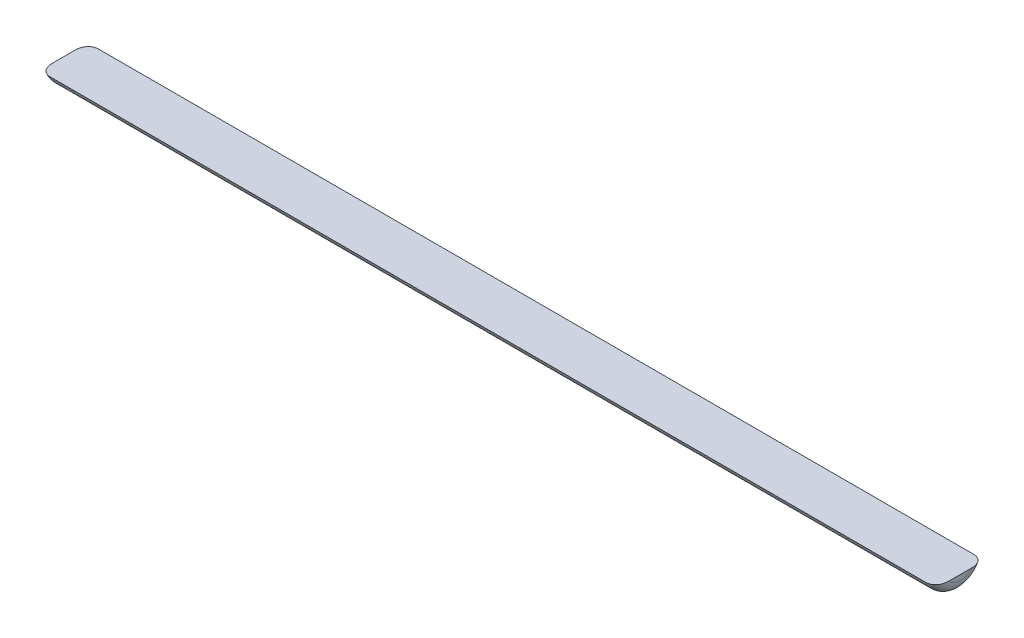
ISO-10303-21;
HEADER;
FILE_DESCRIPTION(('STEP AP214'),'2;1');
FILE_NAME('part.step','',(''),(''),'','','');
FILE_SCHEMA(('AUTOMOTIVE_DESIGN { 1 0 10303 214 1 1 1 1 }'));
ENDSEC;
DATA;
#1=APPLICATION_CONTEXT('core data for automotive mechanical design processes');
#2=APPLICATION_PROTOCOL_DEFINITION('international standard','automotive_design',2000,#1);
#3=PRODUCT_CONTEXT('',#1,'mechanical');
#4=PRODUCT('Part','Part','',(#3));
#5=PRODUCT_RELATED_PRODUCT_CATEGORY('part','',(#4));
#6=PRODUCT_DEFINITION_FORMATION('','',#4);
#7=PRODUCT_DEFINITION_CONTEXT('part definition',#1,'design');
#8=PRODUCT_DEFINITION('design','',#6,#7);
#9=PRODUCT_DEFINITION_SHAPE('','',#8);
#10=(LENGTH_UNIT() NAMED_UNIT(*) SI_UNIT(.MILLI.,.METRE.));
#11=(NAMED_UNIT(*) PLANE_ANGLE_UNIT() SI_UNIT($,.RADIAN.));
#12=(NAMED_UNIT(*) SI_UNIT($,.STERADIAN.) SOLID_ANGLE_UNIT());
#13=UNCERTAINTY_MEASURE_WITH_UNIT(LENGTH_MEASURE(1.E-05),#10,'distance_accuracy_value','');
#14=(GEOMETRIC_REPRESENTATION_CONTEXT(3) GLOBAL_UNCERTAINTY_ASSIGNED_CONTEXT((#13)) GLOBAL_UNIT_ASSIGNED_CONTEXT((#10,
#11,#12)) REPRESENTATION_CONTEXT('',''));
#15=CARTESIAN_POINT('',(0.,0.,0.));
#16=DIRECTION('',(0.,0.,1.));
#17=DIRECTION('',(1.,0.,0.));
#18=AXIS2_PLACEMENT_3D('',#15,#16,#17);
#19=CARTESIAN_POINT('',(170.,0.,0.));
#20=DIRECTION('',(-1.,0.,0.));
#21=DIRECTION('',(0.,0.,1.));
#22=AXIS2_PLACEMENT_3D('',#19,#20,#21);
#23=CYLINDRICAL_SURFACE('',#22,5.);
#24=DIRECTION('',(-1.,0.,0.));
#25=VECTOR('',#24,1.);
#26=CARTESIAN_POINT('',(170.,-2.01726919373693,4.575));
#27=LINE('',#26,#25);
#28=CARTESIAN_POINT('',(168.,-2.01726919373693,4.575));
#29=VERTEX_POINT('',#28);
#30=CARTESIAN_POINT('',(2.,-2.01726919373693,4.575));
#31=VERTEX_POINT('',#30);
#32=EDGE_CURVE('E96',#29,#31,#27,.T.);
#33=ORIENTED_EDGE('',*,*,#32,.T.);
#34=CARTESIAN_POINT('',(2.,0.,0.));
#35=DIRECTION('',(1.,0.,0.));
#36=DIRECTION('',(0.,0.,-1.));
#37=AXIS2_PLACEMENT_3D('',#34,#35,#36);
#38=CIRCLE('',#37,5.);
#39=CARTESIAN_POINT('',(2.,-2.01726919373693,-4.575));
#40=VERTEX_POINT('',#39);
#41=EDGE_CURVE('E94',#31,#40,#38,.T.);
#42=ORIENTED_EDGE('',*,*,#41,.T.);
#43=DIRECTION('',(-1.,0.,0.));
#44=VECTOR('',#43,1.);
#45=CARTESIAN_POINT('',(170.,-2.01726919373693,-4.575));
#46=LINE('',#45,#44);
#47=CARTESIAN_POINT('',(168.,-2.01726919373693,-4.575));
#48=VERTEX_POINT('',#47);
#49=EDGE_CURVE('E84',#48,#40,#46,.T.);
#50=ORIENTED_EDGE('',*,*,#49,.F.);
#51=CARTESIAN_POINT('',(168.,0.,0.));
#52=DIRECTION('',(1.,0.,0.));
#53=DIRECTION('',(0.,0.,-1.));
#54=AXIS2_PLACEMENT_3D('',#51,#52,#53);
#55=CIRCLE('',#54,5.);
#56=EDGE_CURVE('E92',#48,#29,#55,.F.);
#57=ORIENTED_EDGE('',*,*,#56,.T.);
#58=EDGE_LOOP('',(#33,#42,#50,#57));
#59=FACE_BOUND('',#58,.T.);
#60=ADVANCED_FACE('F39',(#59),#23,.T.);
#61=CARTESIAN_POINT('',(170.,-2.01726919373693,4.575));
#62=DIRECTION('',(0.,-1.,0.));
#63=DIRECTION('',(0.,0.,-1.));
#64=AXIS2_PLACEMENT_3D('',#61,#62,#63);
#65=PLANE('',#64);
#66=ORIENTED_EDGE('',*,*,#49,.T.);
#67=CARTESIAN_POINT('',(2.,-2.01726919373693,-4.575));
#68=CARTESIAN_POINT('',(1.94763070247684,-2.01726919373693,-4.57500106428078));
#69=CARTESIAN_POINT('',(1.89528731336726,-2.01726919373693,-4.57275046223957));
#70=CARTESIAN_POINT('',(1.79099273440256,-2.01726919373693,-4.56378179842506));
#71=CARTESIAN_POINT('',(1.73904148519169,-2.01726919373693,-4.55706442705183));
#72=CARTESIAN_POINT('',(1.58460844501989,-2.01726919373693,-4.53032488193447));
#73=CARTESIAN_POINT('',(1.48319133944765,-2.01726919373693,-4.50371470755873));
#74=CARTESIAN_POINT('',(1.28632512836691,-2.01726919373693,-4.43389362228435));
#75=CARTESIAN_POINT('',(1.19087577863297,-2.01726919373693,-4.39068339124694));
#76=CARTESIAN_POINT('',(1.00832828072526,-2.01726919373693,-4.28918932412547));
#77=CARTESIAN_POINT('',(0.921233286167462,-2.01726919373693,-4.23089982634992));
#78=CARTESIAN_POINT('',(0.755523397830325,-2.01726919373693,-4.09970087474135));
#79=CARTESIAN_POINT('',(0.677155672563735,-2.01726919373693,-4.02648024273062));
#80=CARTESIAN_POINT('',(0.532866343289797,-2.01726919373693,-3.86876196622692));
#81=CARTESIAN_POINT('',(0.466940892491163,-2.01726919373693,-3.78426782101391));
#82=CARTESIAN_POINT('',(0.344019527532241,-2.01726919373693,-3.59998920490353));
#83=CARTESIAN_POINT('',(0.288026033297491,-2.01726919373693,-3.49953892957273));
#84=CARTESIAN_POINT('',(0.191431962343708,-2.01726919373693,-3.29126121964576));
#85=CARTESIAN_POINT('',(0.150867472406464,-2.01726919373693,-3.18341717810698));
#86=CARTESIAN_POINT('',(0.0970392326106085,-2.01726919373693,-3.0042486821523));
#87=CARTESIAN_POINT('',(0.0792313748328536,-2.01726919373693,-2.93423670107821));
#88=CARTESIAN_POINT('',(0.0492351345039434,-2.01726919373693,-2.79297125168839));
#89=CARTESIAN_POINT('',(0.0370500995009083,-2.01726919373693,-2.72171706995505));
#90=CARTESIAN_POINT('',(0.0180066761541763,-2.01726919373693,-2.57889412778605));
#91=CARTESIAN_POINT('',(0.0111211571024452,-2.01726919373693,-2.50732888163651));
#92=CARTESIAN_POINT('',(0.00211479261413083,-2.01726919373693,-2.36399795785076));
#93=CARTESIAN_POINT('',(-1.29411029862206E-05,-2.01726919373693,-2.29223272078868));
#94=CARTESIAN_POINT('',(0.,-2.01726919373693,-2.22050106957866));
#95=B_SPLINE_CURVE_WITH_KNOTS('',3,(#67,#68,#69,#70,#71,#72,#73,#74,#75,#76,#77,#78,#79,#80,#81,
#82,#83,#84,#85,#86,#87,#88,#89,#90,#91,#92,#93,#94),.UNSPECIFIED.,.F.,.F.,(4,2,2,2,2,2,2,2,2,2,
2,2,2,4),(0.,0.157008489889655,0.313992717616832,0.626907107642775,0.939808683514453,
1.2528279129767,1.57319781431868,1.89346850371498,2.23710595448495,2.581542265048,
2.79805444853215,3.01469536679036,3.23021968231045,3.44543176099899),.UNSPECIFIED.);
#96=CARTESIAN_POINT('',(0.,-2.01726919373693,-2.22050106957866));
#97=VERTEX_POINT('',#96);
#98=EDGE_CURVE('E131',#40,#97,#95,.T.);
#99=ORIENTED_EDGE('',*,*,#98,.T.);
#100=DIRECTION('',(0.,0.,1.));
#101=VECTOR('',#100,1.);
#102=CARTESIAN_POINT('',(0.,-2.01726919373693,4.575));
#103=LINE('',#102,#101);
#104=CARTESIAN_POINT('',(0.,-2.01726919373693,2.22050106957866));
#105=VERTEX_POINT('',#104);
#106=EDGE_CURVE('E185',#97,#105,#103,.T.);
#107=ORIENTED_EDGE('',*,*,#106,.T.);
#108=CARTESIAN_POINT('',(0.,-2.01726919373693,2.22050106957866));
#109=CARTESIAN_POINT('',(-2.56987076420236E-05,-2.01726919373693,2.30517926120278));
#110=CARTESIAN_POINT('',(0.00294756136359974,-2.01726919373693,2.38992342799188));
#111=CARTESIAN_POINT('',(0.0156398140543698,-2.01726919373693,2.55910216735949));
#112=CARTESIAN_POINT('',(0.0253752040144856,-2.01726919373693,2.64353548477709));
#113=CARTESIAN_POINT('',(0.0524272486071971,-2.01726919373693,2.8117325132984));
#114=CARTESIAN_POINT('',(0.069788761118462,-2.01726919373693,2.89548922999523));
#115=CARTESIAN_POINT('',(0.112603174591213,-2.01726919373693,3.06081312804526));
#116=CARTESIAN_POINT('',(0.138047424077704,-2.01726919373693,3.14238254983069));
#117=CARTESIAN_POINT('',(0.21046494340598,-2.01726919373693,3.33759929912957));
#118=CARTESIAN_POINT('',(0.26198592876179,-2.01726919373693,3.44961440448936));
#119=CARTESIAN_POINT('',(0.382654849224041,-2.01726919373693,3.66334738068124));
#120=CARTESIAN_POINT('',(0.451750994450863,-2.01726919373693,3.76509429974543));
#121=CARTESIAN_POINT('',(0.607276889192287,-2.01726919373693,3.95551164244702));
#122=CARTESIAN_POINT('',(0.693810892983995,-2.01726919373693,4.04409756606028));
#123=CARTESIAN_POINT('',(0.881992775244944,-2.01726919373693,4.20370699514467));
#124=CARTESIAN_POINT('',(0.983650503209227,-2.01726919373693,4.27471897450884));
#125=CARTESIAN_POINT('',(1.18870502642377,-2.01726919373693,4.39010317983569));
#126=CARTESIAN_POINT('',(1.2910553482708,-2.01726919373693,4.43634228999224));
#127=CARTESIAN_POINT('',(1.50230863222573,-2.01726919373693,4.50963402818717));
#128=CARTESIAN_POINT('',(1.61119893870144,-2.01726919373693,4.53672249465091));
#129=CARTESIAN_POINT('',(1.76760620507672,-2.01726919373693,4.56079138417282));
#130=CARTESIAN_POINT('',(1.81396095388096,-2.01726919373693,4.56611922396923));
#131=CARTESIAN_POINT('',(1.90686898899704,-2.01726919373693,4.57321978705606));
#132=CARTESIAN_POINT('',(1.953421851018,-2.01726919373693,4.57499806153331));
#133=CARTESIAN_POINT('',(2.,-2.01726919373693,4.575));
#134=B_SPLINE_CURVE_WITH_KNOTS('',3,(#108,#109,#110,#111,#112,#113,#114,#115,#116,#117,#118,
#119,#120,#121,#122,#123,#124,#125,#126,#127,#128,#129,#130,#131,#132,#133),.UNSPECIFIED.,.F.,
.F.,(4,2,2,2,2,2,2,2,2,2,2,2,4),(0.,0.254078680974648,0.508775632518758,0.764991238343812,
1.0209335189299,1.38919743859937,1.75638849474553,2.12584370169164,2.49554058241387,
2.83075725932001,3.16534494072188,3.30521416584733,3.44486447671807),.UNSPECIFIED.);
#135=EDGE_CURVE('E87',#105,#31,#134,.T.);
#136=ORIENTED_EDGE('',*,*,#135,.T.);
#137=ORIENTED_EDGE('',*,*,#32,.F.);
#138=CARTESIAN_POINT('',(168.,-2.01726919373693,4.575));
#139=CARTESIAN_POINT('',(168.052369297523,-2.01726919373693,4.57500106428078));
#140=CARTESIAN_POINT('',(168.104712686633,-2.01726919373693,4.57275046223957));
#141=CARTESIAN_POINT('',(168.209007265597,-2.01726919373693,4.56378179842506));
#142=CARTESIAN_POINT('',(168.260958514808,-2.01726919373693,4.55706442705182));
#143=CARTESIAN_POINT('',(168.41539155498,-2.01726919373693,4.53032488193447));
#144=CARTESIAN_POINT('',(168.516808660552,-2.01726919373693,4.50371470755873));
#145=CARTESIAN_POINT('',(168.713674871633,-2.01726919373693,4.43389362228435));
#146=CARTESIAN_POINT('',(168.809124221367,-2.01726919373693,4.39068339124695));
#147=CARTESIAN_POINT('',(168.991671719275,-2.01726919373693,4.28918932412548));
#148=CARTESIAN_POINT('',(169.078766713833,-2.01726919373693,4.23089982634992));
#149=CARTESIAN_POINT('',(169.24447660217,-2.01726919373693,4.09970087474135));
#150=CARTESIAN_POINT('',(169.322844327436,-2.01726919373693,4.02648024273062));
#151=CARTESIAN_POINT('',(169.46713365671,-2.01726919373693,3.86876196622692));
#152=CARTESIAN_POINT('',(169.533059107509,-2.01726919373693,3.7842678210139));
#153=CARTESIAN_POINT('',(169.655980472468,-2.01726919373693,3.59998920490353));
#154=CARTESIAN_POINT('',(169.711973966703,-2.01726919373693,3.49953892957274));
#155=CARTESIAN_POINT('',(169.808568037656,-2.01726919373693,3.29126121964576));
#156=CARTESIAN_POINT('',(169.849132527594,-2.01726919373693,3.18341717810698));
#157=CARTESIAN_POINT('',(169.902960767389,-2.01726919373693,3.0042486821523));
#158=CARTESIAN_POINT('',(169.920768625167,-2.01726919373693,2.93423670107821));
#159=CARTESIAN_POINT('',(169.950764865496,-2.01726919373693,2.79297125168839));
#160=CARTESIAN_POINT('',(169.962949900499,-2.01726919373693,2.72171706995506));
#161=CARTESIAN_POINT('',(169.981993323846,-2.01726919373693,2.57889412778605));
#162=CARTESIAN_POINT('',(169.988878842898,-2.01726919373693,2.50732888163651));
#163=CARTESIAN_POINT('',(169.997885207386,-2.01726919373693,2.36399795785075));
#164=CARTESIAN_POINT('',(170.000012941103,-2.01726919373693,2.29223272078867));
#165=CARTESIAN_POINT('',(170.,-2.01726919373693,2.22050106957865));
#166=B_SPLINE_CURVE_WITH_KNOTS('',3,(#138,#139,#140,#141,#142,#143,#144,#145,#146,#147,#148,
#149,#150,#151,#152,#153,#154,#155,#156,#157,#158,#159,#160,#161,#162,#163,#164,#165),
.UNSPECIFIED.,.F.,.F.,(4,2,2,2,2,2,2,2,2,2,2,2,2,4),(0.,0.157008489889667,0.313992717616816,
0.626907107642767,0.939808683514447,1.2528279129767,1.5731978143187,1.89346850371497,
2.23710595448493,2.581542265048,2.79805444853214,3.01469536679035,3.23021968231046,
3.445431760999),.UNSPECIFIED.);
#167=CARTESIAN_POINT('',(170.,-2.01726919373693,2.22050106957866));
#168=VERTEX_POINT('',#167);
#169=EDGE_CURVE('E56',#29,#168,#166,.T.);
#170=ORIENTED_EDGE('',*,*,#169,.T.);
#171=DIRECTION('',(0.,0.,1.));
#172=VECTOR('',#171,1.);
#173=CARTESIAN_POINT('',(170.,-2.01726919373693,4.575));
#174=LINE('',#173,#172);
#175=CARTESIAN_POINT('',(170.,-2.01726919373693,-2.22050106957866));
#176=VERTEX_POINT('',#175);
#177=EDGE_CURVE('E85',#176,#168,#174,.T.);
#178=ORIENTED_EDGE('',*,*,#177,.F.);
#179=CARTESIAN_POINT('',(170.,-2.01726919373693,-2.22050106957866));
#180=CARTESIAN_POINT('',(170.000025698708,-2.01726919373693,-2.30517926120278));
#181=CARTESIAN_POINT('',(169.997052438636,-2.01726919373693,-2.38992342799188));
#182=CARTESIAN_POINT('',(169.984360185946,-2.01726919373693,-2.55910216735949));
#183=CARTESIAN_POINT('',(169.974624795986,-2.01726919373693,-2.64353548477709));
#184=CARTESIAN_POINT('',(169.947572751393,-2.01726919373693,-2.81173251329839));
#185=CARTESIAN_POINT('',(169.930211238882,-2.01726919373693,-2.89548922999523));
#186=CARTESIAN_POINT('',(169.887396825409,-2.01726919373693,-3.06081312804525));
#187=CARTESIAN_POINT('',(169.861952575922,-2.01726919373693,-3.14238254983069));
#188=CARTESIAN_POINT('',(169.789535056594,-2.01726919373693,-3.33759929912956));
#189=CARTESIAN_POINT('',(169.738014071238,-2.01726919373693,-3.44961440448935));
#190=CARTESIAN_POINT('',(169.617345150776,-2.01726919373693,-3.66334738068123));
#191=CARTESIAN_POINT('',(169.548249005549,-2.01726919373693,-3.76509429974543));
#192=CARTESIAN_POINT('',(169.392723110808,-2.01726919373693,-3.95551164244703));
#193=CARTESIAN_POINT('',(169.306189107016,-2.01726919373693,-4.04409756606028));
#194=CARTESIAN_POINT('',(169.118007224755,-2.01726919373693,-4.20370699514466));
#195=CARTESIAN_POINT('',(169.016349496791,-2.01726919373693,-4.27471897450884));
#196=CARTESIAN_POINT('',(168.811294973576,-2.01726919373693,-4.39010317983568));
#197=CARTESIAN_POINT('',(168.708944651729,-2.01726919373693,-4.43634228999223));
#198=CARTESIAN_POINT('',(168.497691367774,-2.01726919373693,-4.50963402818716));
#199=CARTESIAN_POINT('',(168.388801061299,-2.01726919373693,-4.53672249465091));
#200=CARTESIAN_POINT('',(168.232393794923,-2.01726919373693,-4.56079138417282));
#201=CARTESIAN_POINT('',(168.186039046119,-2.01726919373693,-4.56611922396923));
#202=CARTESIAN_POINT('',(168.093131011003,-2.01726919373693,-4.57321978705606));
#203=CARTESIAN_POINT('',(168.046578148982,-2.01726919373693,-4.57499806153331));
#204=CARTESIAN_POINT('',(168.,-2.01726919373693,-4.575));
#205=B_SPLINE_CURVE_WITH_KNOTS('',3,(#179,#180,#181,#182,#183,#184,#185,#186,#187,#188,#189,
#190,#191,#192,#193,#194,#195,#196,#197,#198,#199,#200,#201,#202,#203,#204),.UNSPECIFIED.,.F.,
.F.,(4,2,2,2,2,2,2,2,2,2,2,2,4),(0.,0.254078680974646,0.508775632518756,0.764991238343807,
1.0209335189299,1.38919743859936,1.75638849474553,2.12584370169164,2.49554058241385,
2.83075725931998,3.16534494072187,3.30521416584731,3.44486447671807),.UNSPECIFIED.);
#206=EDGE_CURVE('E64',#176,#48,#205,.T.);
#207=ORIENTED_EDGE('',*,*,#206,.T.);
#208=EDGE_LOOP('',(#66,#99,#107,#136,#137,#170,#178,#207));
#209=FACE_BOUND('',#208,.T.);
#210=ADVANCED_FACE('F83',(#209),#65,.F.);
#211=CARTESIAN_POINT('',(170.,0.,0.));
#212=DIRECTION('',(1.,0.,0.));
#213=DIRECTION('',(0.,0.,-1.));
#214=AXIS2_PLACEMENT_3D('',#211,#212,#213);
#215=PLANE('',#214);
#216=ORIENTED_EDGE('',*,*,#177,.T.);
#217=CARTESIAN_POINT('',(170.,0.,0.));
#218=DIRECTION('',(1.,0.,0.));
#219=DIRECTION('',(0.,0.,-1.));
#220=AXIS2_PLACEMENT_3D('',#217,#218,#219);
#221=CIRCLE('',#220,3.);
#222=EDGE_CURVE('E11',#168,#176,#221,.T.);
#223=ORIENTED_EDGE('',*,*,#222,.T.);
#224=EDGE_LOOP('',(#216,#223));
#225=FACE_BOUND('',#224,.T.);
#226=ADVANCED_FACE('F119',(#225),#215,.T.);
#227=CARTESIAN_POINT('',(0.,0.,0.));
#228=DIRECTION('',(1.,0.,0.));
#229=DIRECTION('',(0.,0.,-1.));
#230=AXIS2_PLACEMENT_3D('',#227,#228,#229);
#231=PLANE('',#230);
#232=ORIENTED_EDGE('',*,*,#106,.F.);
#233=CARTESIAN_POINT('',(0.,0.,0.));
#234=DIRECTION('',(1.,0.,0.));
#235=DIRECTION('',(0.,0.,-1.));
#236=AXIS2_PLACEMENT_3D('',#233,#234,#235);
#237=CIRCLE('',#236,3.);
#238=EDGE_CURVE('E49',#97,#105,#237,.F.);
#239=ORIENTED_EDGE('',*,*,#238,.T.);
#240=EDGE_LOOP('',(#232,#239));
#241=FACE_BOUND('',#240,.T.);
#242=ADVANCED_FACE('F120',(#241),#231,.F.);
#243=CARTESIAN_POINT('',(2.,0.,0.));
#244=DIRECTION('',(1.,0.,0.));
#245=DIRECTION('',(0.,0.,-1.));
#246=AXIS2_PLACEMENT_3D('',#243,#244,#245);
#247=TOROIDAL_SURFACE('',#246,3.,2.);
#248=ORIENTED_EDGE('',*,*,#135,.F.);
#249=ORIENTED_EDGE('',*,*,#238,.F.);
#250=ORIENTED_EDGE('',*,*,#98,.F.);
#251=ORIENTED_EDGE('',*,*,#41,.F.);
#252=EDGE_LOOP('',(#248,#249,#250,#251));
#253=FACE_BOUND('',#252,.T.);
#254=ADVANCED_FACE('F136',(#253),#247,.T.);
#255=CARTESIAN_POINT('',(168.,0.,0.));
#256=DIRECTION('',(1.,0.,0.));
#257=DIRECTION('',(0.,0.,-1.));
#258=AXIS2_PLACEMENT_3D('',#255,#256,#257);
#259=TOROIDAL_SURFACE('',#258,3.,2.);
#260=ORIENTED_EDGE('',*,*,#169,.F.);
#261=ORIENTED_EDGE('',*,*,#56,.F.);
#262=ORIENTED_EDGE('',*,*,#206,.F.);
#263=ORIENTED_EDGE('',*,*,#222,.F.);
#264=EDGE_LOOP('',(#260,#261,#262,#263));
#265=FACE_BOUND('',#264,.T.);
#266=ADVANCED_FACE('F41',(#265),#259,.T.);
#267=CLOSED_SHELL('',(#60,#210,#226,#242,#254,#266));
#268=MANIFOLD_SOLID_BREP('B2',#267);
#269=ADVANCED_BREP_SHAPE_REPRESENTATION('',(#18,#268),#14);
#270=SHAPE_DEFINITION_REPRESENTATION(#9,#269);
ENDSEC;
END-ISO-10303-21;
